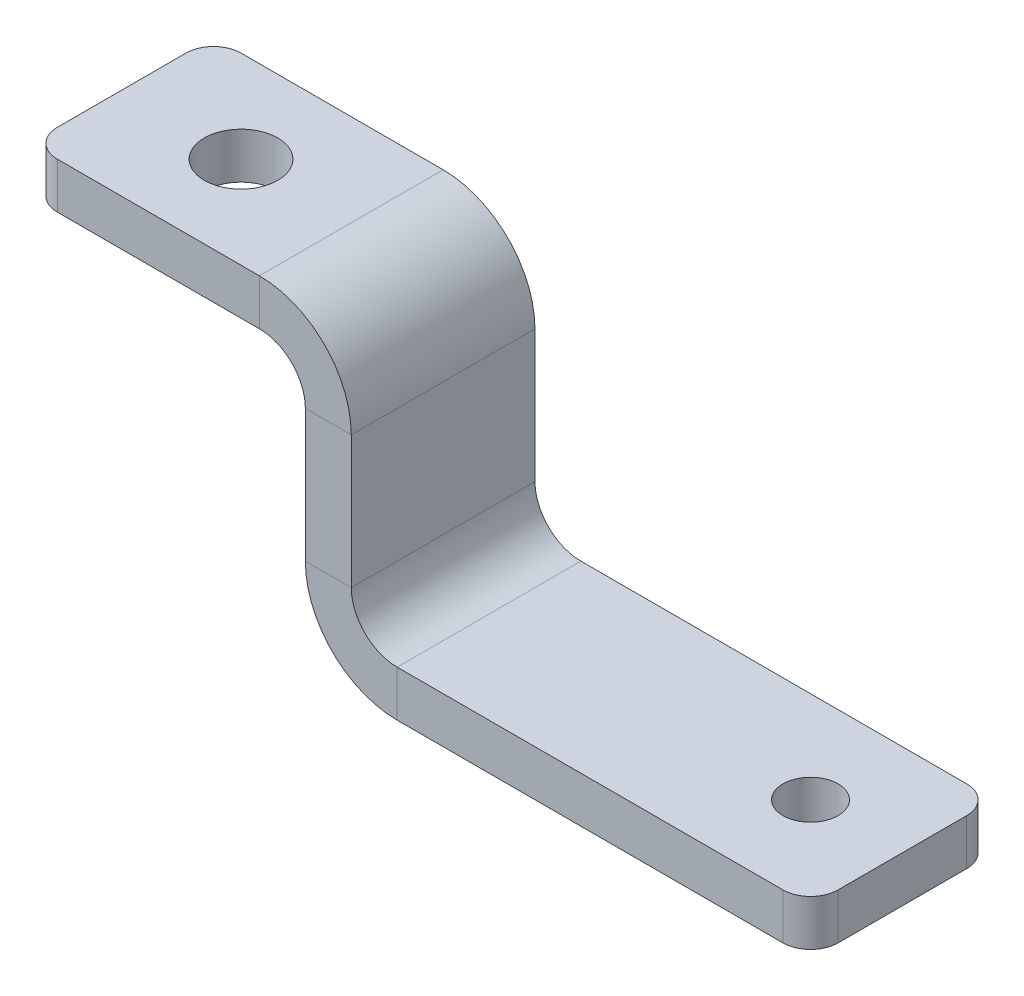
ISO-10303-21;
HEADER;
FILE_DESCRIPTION(('STEP AP214'),'2;1');
FILE_NAME('part.step','',(''),(''),'','','');
FILE_SCHEMA(('AUTOMOTIVE_DESIGN { 1 0 10303 214 1 1 1 1 }'));
ENDSEC;
DATA;
#1=APPLICATION_CONTEXT('core data for automotive mechanical design processes');
#2=APPLICATION_PROTOCOL_DEFINITION('international standard','automotive_design',2000,#1);
#3=PRODUCT_CONTEXT('',#1,'mechanical');
#4=PRODUCT('Part','Part','',(#3));
#5=PRODUCT_RELATED_PRODUCT_CATEGORY('part','',(#4));
#6=PRODUCT_DEFINITION_FORMATION('','',#4);
#7=PRODUCT_DEFINITION_CONTEXT('part definition',#1,'design');
#8=PRODUCT_DEFINITION('design','',#6,#7);
#9=PRODUCT_DEFINITION_SHAPE('','',#8);
#10=(LENGTH_UNIT() NAMED_UNIT(*) SI_UNIT(.MILLI.,.METRE.));
#11=(NAMED_UNIT(*) PLANE_ANGLE_UNIT() SI_UNIT($,.RADIAN.));
#12=(NAMED_UNIT(*) SI_UNIT($,.STERADIAN.) SOLID_ANGLE_UNIT());
#13=UNCERTAINTY_MEASURE_WITH_UNIT(LENGTH_MEASURE(1.E-05),#10,'distance_accuracy_value','');
#14=(GEOMETRIC_REPRESENTATION_CONTEXT(3) GLOBAL_UNCERTAINTY_ASSIGNED_CONTEXT((#13)) GLOBAL_UNIT_ASSIGNED_CONTEXT((#10,
#11,#12)) REPRESENTATION_CONTEXT('',''));
#15=CARTESIAN_POINT('',(0.,0.,0.));
#16=DIRECTION('',(0.,0.,1.));
#17=DIRECTION('',(1.,0.,0.));
#18=AXIS2_PLACEMENT_3D('',#15,#16,#17);
#19=CARTESIAN_POINT('',(0.,29.4,0.));
#20=DIRECTION('',(0.,-1.,0.));
#21=DIRECTION('',(1.,0.,0.));
#22=AXIS2_PLACEMENT_3D('',#19,#20,#21);
#23=PLANE('',#22);
#24=CARTESIAN_POINT('',(-62.,29.4,0.));
#25=DIRECTION('',(0.,1.,0.));
#26=DIRECTION('',(-1.,0.,0.));
#27=AXIS2_PLACEMENT_3D('',#24,#25,#26);
#28=CIRCLE('',#27,4.00000000000001);
#29=CARTESIAN_POINT('',(-66.,29.4,0.));
#30=VERTEX_POINT('',#29);
#31=EDGE_CURVE('E384',#30,#30,#28,.T.);
#32=ORIENTED_EDGE('',*,*,#31,.F.);
#33=EDGE_LOOP('',(#32));
#34=FACE_BOUND('',#33,.T.);
#35=CARTESIAN_POINT('',(-72.0000000000001,29.4,-6.99999999999999));
#36=DIRECTION('',(0.,-1.,0.));
#37=DIRECTION('',(-1.,0.,0.));
#38=AXIS2_PLACEMENT_3D('',#35,#36,#37);
#39=CIRCLE('',#38,3.00000000000001);
#40=CARTESIAN_POINT('',(-75.0000000000001,29.4,-6.99999999999999));
#41=VERTEX_POINT('',#40);
#42=CARTESIAN_POINT('',(-72.0000000000001,29.4,-9.99999999999999));
#43=VERTEX_POINT('',#42);
#44=EDGE_CURVE('E95',#41,#43,#39,.T.);
#45=ORIENTED_EDGE('',*,*,#44,.F.);
#46=DIRECTION('',(0.,0.,1.));
#47=VECTOR('',#46,1.);
#48=CARTESIAN_POINT('',(-75.0000000000001,29.4,0.));
#49=LINE('',#48,#47);
#50=CARTESIAN_POINT('',(-75.0000000000001,29.4,7.));
#51=VERTEX_POINT('',#50);
#52=EDGE_CURVE('E102',#41,#51,#49,.T.);
#53=ORIENTED_EDGE('',*,*,#52,.T.);
#54=CARTESIAN_POINT('',(-72.0000000000001,29.4,7.));
#55=DIRECTION('',(0.,-1.,0.));
#56=DIRECTION('',(-1.,0.,0.));
#57=AXIS2_PLACEMENT_3D('',#54,#55,#56);
#58=CIRCLE('',#57,3.);
#59=CARTESIAN_POINT('',(-72.0000000000001,29.4,10.));
#60=VERTEX_POINT('',#59);
#61=EDGE_CURVE('E206',#60,#51,#58,.T.);
#62=ORIENTED_EDGE('',*,*,#61,.F.);
#63=DIRECTION('',(1.,0.,0.));
#64=VECTOR('',#63,1.);
#65=CARTESIAN_POINT('',(0.,29.4,10.));
#66=LINE('',#65,#64);
#67=CARTESIAN_POINT('',(-50.0000000000001,29.4,10.));
#68=VERTEX_POINT('',#67);
#69=EDGE_CURVE('E245',#60,#68,#66,.T.);
#70=ORIENTED_EDGE('',*,*,#69,.T.);
#71=DIRECTION('',(0.,0.,-1.));
#72=VECTOR('',#71,1.);
#73=CARTESIAN_POINT('',(-50.0000000000001,29.4,10.));
#74=LINE('',#73,#72);
#75=CARTESIAN_POINT('',(-50.0000000000001,29.4,-9.99999999999999));
#76=VERTEX_POINT('',#75);
#77=EDGE_CURVE('E217',#76,#68,#74,.F.);
#78=ORIENTED_EDGE('',*,*,#77,.F.);
#79=DIRECTION('',(-1.,0.,0.));
#80=VECTOR('',#79,1.);
#81=CARTESIAN_POINT('',(0.,29.4,-10.));
#82=LINE('',#81,#80);
#83=EDGE_CURVE('E215',#76,#43,#82,.T.);
#84=ORIENTED_EDGE('',*,*,#83,.T.);
#85=EDGE_LOOP('',(#45,#53,#62,#70,#78,#84));
#86=FACE_BOUND('',#85,.T.);
#87=ADVANCED_FACE('F78',(#34,#86),#23,.F.);
#88=CARTESIAN_POINT('',(0.,24.4,0.));
#89=DIRECTION('',(0.,-1.,0.));
#90=DIRECTION('',(1.,0.,0.));
#91=AXIS2_PLACEMENT_3D('',#88,#89,#90);
#92=PLANE('',#91);
#93=CARTESIAN_POINT('',(-62.,24.4,0.));
#94=DIRECTION('',(0.,1.,0.));
#95=DIRECTION('',(-1.,0.,0.));
#96=AXIS2_PLACEMENT_3D('',#93,#94,#95);
#97=CIRCLE('',#96,4.00000000000001);
#98=CARTESIAN_POINT('',(-66.,24.4,0.));
#99=VERTEX_POINT('',#98);
#100=EDGE_CURVE('E231',#99,#99,#97,.T.);
#101=ORIENTED_EDGE('',*,*,#100,.T.);
#102=EDGE_LOOP('',(#101));
#103=FACE_BOUND('',#102,.T.);
#104=DIRECTION('',(0.,0.,-1.));
#105=VECTOR('',#104,1.);
#106=CARTESIAN_POINT('',(-75.0000000000001,24.4,10.));
#107=LINE('',#106,#105);
#108=CARTESIAN_POINT('',(-75.0000000000001,24.4,-6.99999999999999));
#109=VERTEX_POINT('',#108);
#110=CARTESIAN_POINT('',(-75.0000000000001,24.4,7.));
#111=VERTEX_POINT('',#110);
#112=EDGE_CURVE('E204',#109,#111,#107,.F.);
#113=ORIENTED_EDGE('',*,*,#112,.F.);
#114=CARTESIAN_POINT('',(-72.0000000000001,24.4,-6.99999999999999));
#115=DIRECTION('',(0.,-1.,0.));
#116=DIRECTION('',(1.,0.,0.));
#117=AXIS2_PLACEMENT_3D('',#114,#115,#116);
#118=CIRCLE('',#117,3.00000000000001);
#119=CARTESIAN_POINT('',(-72.0000000000001,24.4,-9.99999999999999));
#120=VERTEX_POINT('',#119);
#121=EDGE_CURVE('E191',#109,#120,#118,.T.);
#122=ORIENTED_EDGE('',*,*,#121,.T.);
#123=DIRECTION('',(1.,0.,0.));
#124=VECTOR('',#123,1.);
#125=CARTESIAN_POINT('',(-75.0000000000001,24.4,-9.99999999999999));
#126=LINE('',#125,#124);
#127=CARTESIAN_POINT('',(-50.0000000000001,24.4,-9.99999999999999));
#128=VERTEX_POINT('',#127);
#129=EDGE_CURVE('E213',#128,#120,#126,.F.);
#130=ORIENTED_EDGE('',*,*,#129,.F.);
#131=DIRECTION('',(0.,0.,-1.));
#132=VECTOR('',#131,1.);
#133=CARTESIAN_POINT('',(-50.0000000000001,24.4,10.));
#134=LINE('',#133,#132);
#135=CARTESIAN_POINT('',(-50.0000000000001,24.4,10.));
#136=VERTEX_POINT('',#135);
#137=EDGE_CURVE('E226',#136,#128,#134,.T.);
#138=ORIENTED_EDGE('',*,*,#137,.F.);
#139=DIRECTION('',(-1.,0.,0.));
#140=VECTOR('',#139,1.);
#141=CARTESIAN_POINT('',(-45.0000000000001,24.4,10.));
#142=LINE('',#141,#140);
#143=CARTESIAN_POINT('',(-72.0000000000001,24.4,10.));
#144=VERTEX_POINT('',#143);
#145=EDGE_CURVE('E212',#144,#136,#142,.F.);
#146=ORIENTED_EDGE('',*,*,#145,.F.);
#147=CARTESIAN_POINT('',(-72.0000000000001,24.4,7.));
#148=DIRECTION('',(0.,-1.,0.));
#149=DIRECTION('',(1.,0.,0.));
#150=AXIS2_PLACEMENT_3D('',#147,#148,#149);
#151=CIRCLE('',#150,3.);
#152=EDGE_CURVE('E211',#144,#111,#151,.T.);
#153=ORIENTED_EDGE('',*,*,#152,.T.);
#154=EDGE_LOOP('',(#113,#122,#130,#138,#146,#153));
#155=FACE_BOUND('',#154,.T.);
#156=ADVANCED_FACE('F209',(#103,#155),#92,.T.);
#157=CARTESIAN_POINT('',(-75.0000000000001,29.4,-9.99999999999999));
#158=DIRECTION('',(0.,0.,1.));
#159=DIRECTION('',(1.,0.,0.));
#160=AXIS2_PLACEMENT_3D('',#157,#158,#159);
#161=PLANE('',#160);
#162=DIRECTION('',(0.,1.,0.));
#163=VECTOR('',#162,1.);
#164=CARTESIAN_POINT('',(-72.0000000000001,29.4,-9.99999999999999));
#165=LINE('',#164,#163);
#166=EDGE_CURVE('E195',#43,#120,#165,.F.);
#167=ORIENTED_EDGE('',*,*,#166,.F.);
#168=ORIENTED_EDGE('',*,*,#83,.F.);
#169=DIRECTION('',(0.,-1.,0.));
#170=VECTOR('',#169,1.);
#171=CARTESIAN_POINT('',(-50.0000000000001,24.4,-9.99999999999999));
#172=LINE('',#171,#170);
#173=EDGE_CURVE('E223',#128,#76,#172,.F.);
#174=ORIENTED_EDGE('',*,*,#173,.F.);
#175=ORIENTED_EDGE('',*,*,#129,.T.);
#176=EDGE_LOOP('',(#167,#168,#174,#175));
#177=FACE_BOUND('',#176,.T.);
#178=ADVANCED_FACE('F368',(#177),#161,.F.);
#179=CARTESIAN_POINT('',(-75.0000000000001,29.4,10.));
#180=DIRECTION('',(1.,0.,0.));
#181=DIRECTION('',(0.,1.,0.));
#182=AXIS2_PLACEMENT_3D('',#179,#180,#181);
#183=PLANE('',#182);
#184=ORIENTED_EDGE('',*,*,#52,.F.);
#185=DIRECTION('',(0.,1.,0.));
#186=VECTOR('',#185,1.);
#187=CARTESIAN_POINT('',(-75.0000000000001,29.4,-6.99999999999999));
#188=LINE('',#187,#186);
#189=EDGE_CURVE('E194',#41,#109,#188,.F.);
#190=ORIENTED_EDGE('',*,*,#189,.T.);
#191=ORIENTED_EDGE('',*,*,#112,.T.);
#192=DIRECTION('',(0.,1.,0.));
#193=VECTOR('',#192,1.);
#194=CARTESIAN_POINT('',(-75.0000000000001,29.4,7.));
#195=LINE('',#194,#193);
#196=EDGE_CURVE('E385',#51,#111,#195,.F.);
#197=ORIENTED_EDGE('',*,*,#196,.F.);
#198=EDGE_LOOP('',(#184,#190,#191,#197));
#199=FACE_BOUND('',#198,.T.);
#200=ADVANCED_FACE('F202',(#199),#183,.F.);
#201=CARTESIAN_POINT('',(-35.,-5.,-10.));
#202=DIRECTION('',(0.,0.,-1.));
#203=DIRECTION('',(-1.,0.,0.));
#204=AXIS2_PLACEMENT_3D('',#201,#202,#203);
#205=PLANE('',#204);
#206=DIRECTION('',(-1.,0.,0.));
#207=VECTOR('',#206,1.);
#208=CARTESIAN_POINT('',(-35.,0.,-10.));
#209=LINE('',#208,#207);
#210=CARTESIAN_POINT('',(7.,0.,-10.));
#211=VERTEX_POINT('',#210);
#212=CARTESIAN_POINT('',(-35.,0.,-10.));
#213=VERTEX_POINT('',#212);
#214=EDGE_CURVE('E302',#211,#213,#209,.T.);
#215=ORIENTED_EDGE('',*,*,#214,.F.);
#216=DIRECTION('',(0.,1.,0.));
#217=VECTOR('',#216,1.);
#218=CARTESIAN_POINT('',(7.,-5.,-10.));
#219=LINE('',#218,#217);
#220=CARTESIAN_POINT('',(7.,-5.,-10.));
#221=VERTEX_POINT('',#220);
#222=EDGE_CURVE('E87',#221,#211,#219,.T.);
#223=ORIENTED_EDGE('',*,*,#222,.F.);
#224=DIRECTION('',(-1.,0.,0.));
#225=VECTOR('',#224,1.);
#226=CARTESIAN_POINT('',(-35.,-5.,-10.));
#227=LINE('',#226,#225);
#228=CARTESIAN_POINT('',(-35.,-5.,-10.));
#229=VERTEX_POINT('',#228);
#230=EDGE_CURVE('E314',#221,#229,#227,.T.);
#231=ORIENTED_EDGE('',*,*,#230,.T.);
#232=DIRECTION('',(0.,1.,0.));
#233=VECTOR('',#232,1.);
#234=CARTESIAN_POINT('',(-35.,-5.,-10.));
#235=LINE('',#234,#233);
#236=EDGE_CURVE('E13',#229,#213,#235,.T.);
#237=ORIENTED_EDGE('',*,*,#236,.T.);
#238=EDGE_LOOP('',(#215,#223,#231,#237));
#239=FACE_BOUND('',#238,.T.);
#240=ADVANCED_FACE('F418',(#239),#205,.T.);
#241=CARTESIAN_POINT('',(7.,-5.,-7.));
#242=DIRECTION('',(0.,1.,0.));
#243=DIRECTION('',(0.,0.,1.));
#244=AXIS2_PLACEMENT_3D('',#241,#242,#243);
#245=CYLINDRICAL_SURFACE('',#244,3.);
#246=CARTESIAN_POINT('',(7.,0.,-7.));
#247=DIRECTION('',(0.,1.,0.));
#248=DIRECTION('',(0.,0.,-1.));
#249=AXIS2_PLACEMENT_3D('',#246,#247,#248);
#250=CIRCLE('',#249,3.);
#251=CARTESIAN_POINT('',(10.,0.,-7.));
#252=VERTEX_POINT('',#251);
#253=EDGE_CURVE('E328',#252,#211,#250,.T.);
#254=ORIENTED_EDGE('',*,*,#253,.F.);
#255=DIRECTION('',(0.,1.,0.));
#256=VECTOR('',#255,1.);
#257=CARTESIAN_POINT('',(10.,-5.,-7.));
#258=LINE('',#257,#256);
#259=CARTESIAN_POINT('',(10.,-5.,-7.));
#260=VERTEX_POINT('',#259);
#261=EDGE_CURVE('E334',#260,#252,#258,.T.);
#262=ORIENTED_EDGE('',*,*,#261,.F.);
#263=CARTESIAN_POINT('',(7.,-5.,-7.));
#264=DIRECTION('',(0.,1.,0.));
#265=DIRECTION('',(0.,0.,-1.));
#266=AXIS2_PLACEMENT_3D('',#263,#264,#265);
#267=CIRCLE('',#266,3.);
#268=EDGE_CURVE('E311',#260,#221,#267,.T.);
#269=ORIENTED_EDGE('',*,*,#268,.T.);
#270=ORIENTED_EDGE('',*,*,#222,.T.);
#271=EDGE_LOOP('',(#254,#262,#269,#270));
#272=FACE_BOUND('',#271,.T.);
#273=ADVANCED_FACE('F467',(#272),#245,.T.);
#274=CARTESIAN_POINT('',(10.,-5.,-7.));
#275=DIRECTION('',(1.,0.,0.));
#276=DIRECTION('',(0.,0.,-1.));
#277=AXIS2_PLACEMENT_3D('',#274,#275,#276);
#278=PLANE('',#277);
#279=DIRECTION('',(0.,0.,-1.));
#280=VECTOR('',#279,1.);
#281=CARTESIAN_POINT('',(10.,0.,-7.));
#282=LINE('',#281,#280);
#283=CARTESIAN_POINT('',(10.,0.,7.));
#284=VERTEX_POINT('',#283);
#285=EDGE_CURVE('E325',#284,#252,#282,.T.);
#286=ORIENTED_EDGE('',*,*,#285,.F.);
#287=DIRECTION('',(0.,1.,0.));
#288=VECTOR('',#287,1.);
#289=CARTESIAN_POINT('',(10.,-5.,7.));
#290=LINE('',#289,#288);
#291=CARTESIAN_POINT('',(10.,-5.,7.));
#292=VERTEX_POINT('',#291);
#293=EDGE_CURVE('E336',#292,#284,#290,.T.);
#294=ORIENTED_EDGE('',*,*,#293,.F.);
#295=DIRECTION('',(0.,0.,-1.));
#296=VECTOR('',#295,1.);
#297=CARTESIAN_POINT('',(10.,-5.,-7.));
#298=LINE('',#297,#296);
#299=EDGE_CURVE('E308',#292,#260,#298,.T.);
#300=ORIENTED_EDGE('',*,*,#299,.T.);
#301=ORIENTED_EDGE('',*,*,#261,.T.);
#302=EDGE_LOOP('',(#286,#294,#300,#301));
#303=FACE_BOUND('',#302,.T.);
#304=ADVANCED_FACE('F471',(#303),#278,.T.);
#305=CARTESIAN_POINT('',(7.,-5.,7.));
#306=DIRECTION('',(0.,1.,0.));
#307=DIRECTION('',(0.,0.,1.));
#308=AXIS2_PLACEMENT_3D('',#305,#306,#307);
#309=CYLINDRICAL_SURFACE('',#308,3.);
#310=CARTESIAN_POINT('',(7.,0.,7.));
#311=DIRECTION('',(0.,1.,0.));
#312=DIRECTION('',(0.,0.,1.));
#313=AXIS2_PLACEMENT_3D('',#310,#311,#312);
#314=CIRCLE('',#313,3.);
#315=CARTESIAN_POINT('',(7.,0.,10.));
#316=VERTEX_POINT('',#315);
#317=EDGE_CURVE('E322',#316,#284,#314,.T.);
#318=ORIENTED_EDGE('',*,*,#317,.F.);
#319=DIRECTION('',(0.,1.,0.));
#320=VECTOR('',#319,1.);
#321=CARTESIAN_POINT('',(7.,-5.,10.));
#322=LINE('',#321,#320);
#323=CARTESIAN_POINT('',(7.,-5.,10.));
#324=VERTEX_POINT('',#323);
#325=EDGE_CURVE('E337',#324,#316,#322,.T.);
#326=ORIENTED_EDGE('',*,*,#325,.F.);
#327=CARTESIAN_POINT('',(7.,-5.,7.));
#328=DIRECTION('',(0.,1.,0.));
#329=DIRECTION('',(0.,0.,1.));
#330=AXIS2_PLACEMENT_3D('',#327,#328,#329);
#331=CIRCLE('',#330,3.);
#332=EDGE_CURVE('E305',#324,#292,#331,.T.);
#333=ORIENTED_EDGE('',*,*,#332,.T.);
#334=ORIENTED_EDGE('',*,*,#293,.T.);
#335=EDGE_LOOP('',(#318,#326,#333,#334));
#336=FACE_BOUND('',#335,.T.);
#337=ADVANCED_FACE('F474',(#336),#309,.T.);
#338=CARTESIAN_POINT('',(-35.,-5.,10.));
#339=DIRECTION('',(0.,0.,1.));
#340=DIRECTION('',(1.,0.,0.));
#341=AXIS2_PLACEMENT_3D('',#338,#339,#340);
#342=PLANE('',#341);
#343=DIRECTION('',(1.,0.,0.));
#344=VECTOR('',#343,1.);
#345=CARTESIAN_POINT('',(-35.,0.,10.));
#346=LINE('',#345,#344);
#347=CARTESIAN_POINT('',(-35.,0.,10.));
#348=VERTEX_POINT('',#347);
#349=EDGE_CURVE('E319',#348,#316,#346,.T.);
#350=ORIENTED_EDGE('',*,*,#349,.F.);
#351=DIRECTION('',(0.,1.,0.));
#352=VECTOR('',#351,1.);
#353=CARTESIAN_POINT('',(-35.,-5.,10.));
#354=LINE('',#353,#352);
#355=CARTESIAN_POINT('',(-35.,-5.,10.));
#356=VERTEX_POINT('',#355);
#357=EDGE_CURVE('E82',#356,#348,#354,.T.);
#358=ORIENTED_EDGE('',*,*,#357,.F.);
#359=DIRECTION('',(1.,0.,0.));
#360=VECTOR('',#359,1.);
#361=CARTESIAN_POINT('',(-35.,-5.,10.));
#362=LINE('',#361,#360);
#363=EDGE_CURVE('E301',#356,#324,#362,.T.);
#364=ORIENTED_EDGE('',*,*,#363,.T.);
#365=ORIENTED_EDGE('',*,*,#325,.T.);
#366=EDGE_LOOP('',(#350,#358,#364,#365));
#367=FACE_BOUND('',#366,.T.);
#368=ADVANCED_FACE('F80',(#367),#342,.T.);
#369=CARTESIAN_POINT('',(7.,-5.,7.));
#370=DIRECTION('',(0.,1.,0.));
#371=DIRECTION('',(0.,0.,1.));
#372=AXIS2_PLACEMENT_3D('',#369,#370,#371);
#373=PLANE('',#372);
#374=CARTESIAN_POINT('',(0.,-5.,0.));
#375=DIRECTION('',(0.,1.,0.));
#376=DIRECTION('',(0.,0.,1.));
#377=AXIS2_PLACEMENT_3D('',#374,#375,#376);
#378=CIRCLE('',#377,3.);
#379=CARTESIAN_POINT('',(0.,-5.,3.));
#380=VERTEX_POINT('',#379);
#381=EDGE_CURVE('E292',#380,#380,#378,.T.);
#382=ORIENTED_EDGE('',*,*,#381,.T.);
#383=EDGE_LOOP('',(#382));
#384=FACE_BOUND('',#383,.T.);
#385=DIRECTION('',(0.,0.,1.));
#386=VECTOR('',#385,1.);
#387=CARTESIAN_POINT('',(-35.,-5.,-10.));
#388=LINE('',#387,#386);
#389=EDGE_CURVE('E298',#229,#356,#388,.T.);
#390=ORIENTED_EDGE('',*,*,#389,.F.);
#391=ORIENTED_EDGE('',*,*,#230,.F.);
#392=ORIENTED_EDGE('',*,*,#268,.F.);
#393=ORIENTED_EDGE('',*,*,#299,.F.);
#394=ORIENTED_EDGE('',*,*,#332,.F.);
#395=ORIENTED_EDGE('',*,*,#363,.F.);
#396=EDGE_LOOP('',(#390,#391,#392,#393,#394,#395));
#397=FACE_BOUND('',#396,.T.);
#398=ADVANCED_FACE('F458',(#384,#397),#373,.F.);
#399=CARTESIAN_POINT('',(7.,0.,7.));
#400=DIRECTION('',(0.,1.,0.));
#401=DIRECTION('',(0.,0.,1.));
#402=AXIS2_PLACEMENT_3D('',#399,#400,#401);
#403=PLANE('',#402);
#404=CARTESIAN_POINT('',(0.,0.,0.));
#405=DIRECTION('',(0.,1.,0.));
#406=DIRECTION('',(0.,0.,1.));
#407=AXIS2_PLACEMENT_3D('',#404,#405,#406);
#408=CIRCLE('',#407,3.);
#409=CARTESIAN_POINT('',(0.,0.,3.));
#410=VERTEX_POINT('',#409);
#411=EDGE_CURVE('E283',#410,#410,#408,.T.);
#412=ORIENTED_EDGE('',*,*,#411,.F.);
#413=EDGE_LOOP('',(#412));
#414=FACE_BOUND('',#413,.T.);
#415=DIRECTION('',(0.,0.,1.));
#416=VECTOR('',#415,1.);
#417=CARTESIAN_POINT('',(-35.,0.,-10.));
#418=LINE('',#417,#416);
#419=EDGE_CURVE('E295',#213,#348,#418,.T.);
#420=ORIENTED_EDGE('',*,*,#419,.T.);
#421=ORIENTED_EDGE('',*,*,#349,.T.);
#422=ORIENTED_EDGE('',*,*,#317,.T.);
#423=ORIENTED_EDGE('',*,*,#285,.T.);
#424=ORIENTED_EDGE('',*,*,#253,.T.);
#425=ORIENTED_EDGE('',*,*,#214,.T.);
#426=EDGE_LOOP('',(#420,#421,#422,#423,#424,#425));
#427=FACE_BOUND('',#426,.T.);
#428=ADVANCED_FACE('F456',(#414,#427),#403,.T.);
#429=CARTESIAN_POINT('',(0.,-5.,0.));
#430=DIRECTION('',(0.,1.,0.));
#431=DIRECTION('',(0.,0.,1.));
#432=AXIS2_PLACEMENT_3D('',#429,#430,#431);
#433=CYLINDRICAL_SURFACE('',#432,3.);
#434=ORIENTED_EDGE('',*,*,#381,.F.);
#435=EDGE_LOOP('',(#434));
#436=FACE_BOUND('',#435,.T.);
#437=ORIENTED_EDGE('',*,*,#411,.T.);
#438=EDGE_LOOP('',(#437));
#439=FACE_BOUND('',#438,.T.);
#440=ADVANCED_FACE('F450',(#436,#439),#433,.F.);
#441=CARTESIAN_POINT('',(-35.,5.,-10.));
#442=DIRECTION('',(0.,0.,-1.));
#443=DIRECTION('',(-1.,0.,0.));
#444=AXIS2_PLACEMENT_3D('',#441,#442,#443);
#445=PLANE('',#444);
#446=DIRECTION('',(-1.,0.,0.));
#447=VECTOR('',#446,1.);
#448=CARTESIAN_POINT('',(-45.,4.99999999999997,-10.));
#449=LINE('',#448,#447);
#450=CARTESIAN_POINT('',(-40.,4.99999999999998,-10.));
#451=VERTEX_POINT('',#450);
#452=CARTESIAN_POINT('',(-45.,4.99999999999997,-10.));
#453=VERTEX_POINT('',#452);
#454=EDGE_CURVE('E235',#451,#453,#449,.T.);
#455=ORIENTED_EDGE('',*,*,#454,.F.);
#456=CARTESIAN_POINT('',(-35.,5.,-10.));
#457=DIRECTION('',(0.,0.,1.));
#458=DIRECTION('',(1.,0.,0.));
#459=AXIS2_PLACEMENT_3D('',#456,#457,#458);
#460=CIRCLE('',#459,5.);
#461=EDGE_CURVE('E287',#213,#451,#460,.F.);
#462=ORIENTED_EDGE('',*,*,#461,.F.);
#463=ORIENTED_EDGE('',*,*,#236,.F.);
#464=CARTESIAN_POINT('',(-35.,5.,-10.));
#465=DIRECTION('',(0.,0.,1.));
#466=DIRECTION('',(1.,0.,0.));
#467=AXIS2_PLACEMENT_3D('',#464,#465,#466);
#468=CIRCLE('',#467,10.);
#469=EDGE_CURVE('E280',#229,#453,#468,.F.);
#470=ORIENTED_EDGE('',*,*,#469,.T.);
#471=EDGE_LOOP('',(#455,#462,#463,#470));
#472=FACE_BOUND('',#471,.T.);
#473=ADVANCED_FACE('F447',(#472),#445,.T.);
#474=CARTESIAN_POINT('',(-35.,5.,10.));
#475=DIRECTION('',(0.,0.,-1.));
#476=DIRECTION('',(-1.,0.,0.));
#477=AXIS2_PLACEMENT_3D('',#474,#475,#476);
#478=PLANE('',#477);
#479=CARTESIAN_POINT('',(-35.,5.,10.));
#480=DIRECTION('',(0.,0.,1.));
#481=DIRECTION('',(1.,0.,0.));
#482=AXIS2_PLACEMENT_3D('',#479,#480,#481);
#483=CIRCLE('',#482,5.);
#484=CARTESIAN_POINT('',(-40.,4.99999999999998,10.));
#485=VERTEX_POINT('',#484);
#486=EDGE_CURVE('E249',#485,#348,#483,.T.);
#487=ORIENTED_EDGE('',*,*,#486,.F.);
#488=DIRECTION('',(-1.,0.,0.));
#489=VECTOR('',#488,1.);
#490=CARTESIAN_POINT('',(-40.,4.99999999999998,10.));
#491=LINE('',#490,#489);
#492=CARTESIAN_POINT('',(-45.,4.99999999999997,10.));
#493=VERTEX_POINT('',#492);
#494=EDGE_CURVE('E273',#485,#493,#491,.T.);
#495=ORIENTED_EDGE('',*,*,#494,.T.);
#496=CARTESIAN_POINT('',(-35.,5.,10.));
#497=DIRECTION('',(0.,0.,1.));
#498=DIRECTION('',(1.,0.,0.));
#499=AXIS2_PLACEMENT_3D('',#496,#497,#498);
#500=CIRCLE('',#499,10.);
#501=EDGE_CURVE('E284',#493,#356,#500,.T.);
#502=ORIENTED_EDGE('',*,*,#501,.T.);
#503=ORIENTED_EDGE('',*,*,#357,.T.);
#504=EDGE_LOOP('',(#487,#495,#502,#503));
#505=FACE_BOUND('',#504,.T.);
#506=ADVANCED_FACE('F344',(#505),#478,.F.);
#507=CARTESIAN_POINT('',(-35.,5.,10.));
#508=DIRECTION('',(0.,0.,1.));
#509=DIRECTION('',(-1.,0.,0.));
#510=AXIS2_PLACEMENT_3D('',#507,#508,#509);
#511=CYLINDRICAL_SURFACE('',#510,10.);
#512=ORIENTED_EDGE('',*,*,#389,.T.);
#513=ORIENTED_EDGE('',*,*,#501,.F.);
#514=DIRECTION('',(0.,0.,1.));
#515=VECTOR('',#514,1.);
#516=CARTESIAN_POINT('',(-45.,4.99999999999997,0.));
#517=LINE('',#516,#515);
#518=EDGE_CURVE('E270',#453,#493,#517,.T.);
#519=ORIENTED_EDGE('',*,*,#518,.F.);
#520=ORIENTED_EDGE('',*,*,#469,.F.);
#521=EDGE_LOOP('',(#512,#513,#519,#520));
#522=FACE_BOUND('',#521,.T.);
#523=ADVANCED_FACE('F441',(#522),#511,.T.);
#524=CARTESIAN_POINT('',(-35.,5.,10.));
#525=DIRECTION('',(0.,0.,1.));
#526=DIRECTION('',(-1.,0.,0.));
#527=AXIS2_PLACEMENT_3D('',#524,#525,#526);
#528=CYLINDRICAL_SURFACE('',#527,5.);
#529=ORIENTED_EDGE('',*,*,#419,.F.);
#530=ORIENTED_EDGE('',*,*,#461,.T.);
#531=DIRECTION('',(0.,0.,-1.));
#532=VECTOR('',#531,1.);
#533=CARTESIAN_POINT('',(-40.,4.99999999999998,-10.));
#534=LINE('',#533,#532);
#535=EDGE_CURVE('E276',#451,#485,#534,.F.);
#536=ORIENTED_EDGE('',*,*,#535,.T.);
#537=ORIENTED_EDGE('',*,*,#486,.T.);
#538=EDGE_LOOP('',(#529,#530,#536,#537));
#539=FACE_BOUND('',#538,.T.);
#540=ADVANCED_FACE('F347',(#539),#528,.F.);
#541=CARTESIAN_POINT('',(-45.,0.,10.));
#542=DIRECTION('',(0.,0.,1.));
#543=DIRECTION('',(1.,0.,0.));
#544=AXIS2_PLACEMENT_3D('',#541,#542,#543);
#545=PLANE('',#544);
#546=DIRECTION('',(0.,-1.,0.));
#547=VECTOR('',#546,1.);
#548=CARTESIAN_POINT('',(-45.,0.,10.));
#549=LINE('',#548,#547);
#550=CARTESIAN_POINT('',(-45.0000000000001,19.4,10.));
#551=VERTEX_POINT('',#550);
#552=EDGE_CURVE('E253',#551,#493,#549,.T.);
#553=ORIENTED_EDGE('',*,*,#552,.T.);
#554=ORIENTED_EDGE('',*,*,#494,.F.);
#555=DIRECTION('',(0.,1.,0.));
#556=VECTOR('',#555,1.);
#557=CARTESIAN_POINT('',(-40.,-1.2518623022513E-13,10.));
#558=LINE('',#557,#556);
#559=CARTESIAN_POINT('',(-40.,19.4,10.));
#560=VERTEX_POINT('',#559);
#561=EDGE_CURVE('E261',#560,#485,#558,.F.);
#562=ORIENTED_EDGE('',*,*,#561,.F.);
#563=DIRECTION('',(1.,0.,0.));
#564=VECTOR('',#563,1.);
#565=CARTESIAN_POINT('',(-45.,19.4,10.));
#566=LINE('',#565,#564);
#567=EDGE_CURVE('E246',#551,#560,#566,.T.);
#568=ORIENTED_EDGE('',*,*,#567,.F.);
#569=EDGE_LOOP('',(#553,#554,#562,#568));
#570=FACE_BOUND('',#569,.T.);
#571=ADVANCED_FACE('F435',(#570),#545,.T.);
#572=CARTESIAN_POINT('',(-45.,19.4,-10.));
#573=DIRECTION('',(0.,0.,-1.));
#574=DIRECTION('',(0.,1.,0.));
#575=AXIS2_PLACEMENT_3D('',#572,#573,#574);
#576=PLANE('',#575);
#577=DIRECTION('',(0.,-1.,0.));
#578=VECTOR('',#577,1.);
#579=CARTESIAN_POINT('',(-40.,-1.24292042866379E-13,-10.));
#580=LINE('',#579,#578);
#581=CARTESIAN_POINT('',(-40.,19.4,-9.99999999999999));
#582=VERTEX_POINT('',#581);
#583=EDGE_CURVE('E267',#451,#582,#580,.F.);
#584=ORIENTED_EDGE('',*,*,#583,.F.);
#585=ORIENTED_EDGE('',*,*,#454,.T.);
#586=DIRECTION('',(0.,1.,0.));
#587=VECTOR('',#586,1.);
#588=CARTESIAN_POINT('',(-45.,19.4,-10.));
#589=LINE('',#588,#587);
#590=CARTESIAN_POINT('',(-45.0000000000001,19.4,-9.99999999999999));
#591=VERTEX_POINT('',#590);
#592=EDGE_CURVE('E258',#453,#591,#589,.T.);
#593=ORIENTED_EDGE('',*,*,#592,.T.);
#594=DIRECTION('',(1.,0.,0.));
#595=VECTOR('',#594,1.);
#596=CARTESIAN_POINT('',(-45.,19.4,-10.));
#597=LINE('',#596,#595);
#598=EDGE_CURVE('E250',#591,#582,#597,.T.);
#599=ORIENTED_EDGE('',*,*,#598,.T.);
#600=EDGE_LOOP('',(#584,#585,#593,#599));
#601=FACE_BOUND('',#600,.T.);
#602=ADVANCED_FACE('F356',(#601),#576,.T.);
#603=CARTESIAN_POINT('',(-45.,-1.42643636919346E-13,0.));
#604=DIRECTION('',(-1.,0.,0.));
#605=DIRECTION('',(0.,-1.,0.));
#606=AXIS2_PLACEMENT_3D('',#603,#604,#605);
#607=PLANE('',#606);
#608=ORIENTED_EDGE('',*,*,#592,.F.);
#609=ORIENTED_EDGE('',*,*,#518,.T.);
#610=ORIENTED_EDGE('',*,*,#552,.F.);
#611=DIRECTION('',(0.,0.,1.));
#612=VECTOR('',#611,1.);
#613=CARTESIAN_POINT('',(-45.,19.4,10.));
#614=LINE('',#613,#612);
#615=EDGE_CURVE('E256',#591,#551,#614,.T.);
#616=ORIENTED_EDGE('',*,*,#615,.F.);
#617=EDGE_LOOP('',(#608,#609,#610,#616));
#618=FACE_BOUND('',#617,.T.);
#619=ADVANCED_FACE('F429',(#618),#607,.T.);
#620=CARTESIAN_POINT('',(-40.,-1.2518623022513E-13,0.));
#621=DIRECTION('',(-1.,0.,0.));
#622=DIRECTION('',(0.,-1.,0.));
#623=AXIS2_PLACEMENT_3D('',#620,#621,#622);
#624=PLANE('',#623);
#625=ORIENTED_EDGE('',*,*,#535,.F.);
#626=ORIENTED_EDGE('',*,*,#583,.T.);
#627=DIRECTION('',(0.,0.,-1.));
#628=VECTOR('',#627,1.);
#629=CARTESIAN_POINT('',(-40.,19.4,0.));
#630=LINE('',#629,#628);
#631=EDGE_CURVE('E264',#582,#560,#630,.F.);
#632=ORIENTED_EDGE('',*,*,#631,.T.);
#633=ORIENTED_EDGE('',*,*,#561,.T.);
#634=EDGE_LOOP('',(#625,#626,#632,#633));
#635=FACE_BOUND('',#634,.T.);
#636=ADVANCED_FACE('F352',(#635),#624,.F.);
#637=CARTESIAN_POINT('',(-50.0000000000001,19.4,10.));
#638=DIRECTION('',(0.,0.,1.));
#639=DIRECTION('',(1.,0.,0.));
#640=AXIS2_PLACEMENT_3D('',#637,#638,#639);
#641=PLANE('',#640);
#642=DIRECTION('',(0.,-1.,0.));
#643=VECTOR('',#642,1.);
#644=CARTESIAN_POINT('',(-50.0000000000001,29.4,10.));
#645=LINE('',#644,#643);
#646=EDGE_CURVE('E228',#136,#68,#645,.F.);
#647=ORIENTED_EDGE('',*,*,#646,.F.);
#648=CARTESIAN_POINT('',(-50.0000000000001,19.4,10.));
#649=DIRECTION('',(0.,0.,-1.));
#650=DIRECTION('',(-1.,0.,0.));
#651=AXIS2_PLACEMENT_3D('',#648,#649,#650);
#652=CIRCLE('',#651,5.);
#653=EDGE_CURVE('E239',#551,#136,#652,.F.);
#654=ORIENTED_EDGE('',*,*,#653,.F.);
#655=ORIENTED_EDGE('',*,*,#567,.T.);
#656=CARTESIAN_POINT('',(-50.0000000000001,19.4,10.));
#657=DIRECTION('',(0.,0.,-1.));
#658=DIRECTION('',(-1.,0.,0.));
#659=AXIS2_PLACEMENT_3D('',#656,#657,#658);
#660=CIRCLE('',#659,10.);
#661=EDGE_CURVE('E232',#560,#68,#660,.F.);
#662=ORIENTED_EDGE('',*,*,#661,.T.);
#663=EDGE_LOOP('',(#647,#654,#655,#662));
#664=FACE_BOUND('',#663,.T.);
#665=ADVANCED_FACE('F377',(#664),#641,.T.);
#666=CARTESIAN_POINT('',(-50.0000000000001,19.4,-9.99999999999999));
#667=DIRECTION('',(0.,0.,1.));
#668=DIRECTION('',(1.,0.,0.));
#669=AXIS2_PLACEMENT_3D('',#666,#667,#668);
#670=PLANE('',#669);
#671=CARTESIAN_POINT('',(-50.0000000000001,19.4,-9.99999999999999));
#672=DIRECTION('',(0.,0.,-1.));
#673=DIRECTION('',(-1.,0.,0.));
#674=AXIS2_PLACEMENT_3D('',#671,#672,#673);
#675=CIRCLE('',#674,5.);
#676=EDGE_CURVE('E242',#128,#591,#675,.T.);
#677=ORIENTED_EDGE('',*,*,#676,.F.);
#678=ORIENTED_EDGE('',*,*,#173,.T.);
#679=CARTESIAN_POINT('',(-50.0000000000001,19.4,-9.99999999999999));
#680=DIRECTION('',(0.,0.,-1.));
#681=DIRECTION('',(-1.,0.,0.));
#682=AXIS2_PLACEMENT_3D('',#679,#680,#681);
#683=CIRCLE('',#682,10.);
#684=EDGE_CURVE('E236',#76,#582,#683,.T.);
#685=ORIENTED_EDGE('',*,*,#684,.T.);
#686=ORIENTED_EDGE('',*,*,#598,.F.);
#687=EDGE_LOOP('',(#677,#678,#685,#686));
#688=FACE_BOUND('',#687,.T.);
#689=ADVANCED_FACE('F361',(#688),#670,.F.);
#690=CARTESIAN_POINT('',(-50.0000000000001,19.4,-9.99999999999999));
#691=DIRECTION('',(0.,0.,-1.));
#692=DIRECTION('',(0.,1.,0.));
#693=AXIS2_PLACEMENT_3D('',#690,#691,#692);
#694=CYLINDRICAL_SURFACE('',#693,10.);
#695=ORIENTED_EDGE('',*,*,#631,.F.);
#696=ORIENTED_EDGE('',*,*,#684,.F.);
#697=ORIENTED_EDGE('',*,*,#77,.T.);
#698=ORIENTED_EDGE('',*,*,#661,.F.);
#699=EDGE_LOOP('',(#695,#696,#697,#698));
#700=FACE_BOUND('',#699,.T.);
#701=ADVANCED_FACE('F374',(#700),#694,.T.);
#702=CARTESIAN_POINT('',(-50.0000000000001,19.4,-9.99999999999999));
#703=DIRECTION('',(0.,0.,-1.));
#704=DIRECTION('',(0.,1.,0.));
#705=AXIS2_PLACEMENT_3D('',#702,#703,#704);
#706=CYLINDRICAL_SURFACE('',#705,5.);
#707=ORIENTED_EDGE('',*,*,#615,.T.);
#708=ORIENTED_EDGE('',*,*,#653,.T.);
#709=ORIENTED_EDGE('',*,*,#137,.T.);
#710=ORIENTED_EDGE('',*,*,#676,.T.);
#711=EDGE_LOOP('',(#707,#708,#709,#710));
#712=FACE_BOUND('',#711,.T.);
#713=ADVANCED_FACE('F364',(#712),#706,.F.);
#714=CARTESIAN_POINT('',(-45.0000000000001,29.4,10.));
#715=DIRECTION('',(0.,0.,-1.));
#716=DIRECTION('',(-1.,0.,0.));
#717=AXIS2_PLACEMENT_3D('',#714,#715,#716);
#718=PLANE('',#717);
#719=ORIENTED_EDGE('',*,*,#69,.F.);
#720=DIRECTION('',(0.,1.,0.));
#721=VECTOR('',#720,1.);
#722=CARTESIAN_POINT('',(-72.0000000000001,29.4,10.));
#723=LINE('',#722,#721);
#724=EDGE_CURVE('E382',#60,#144,#723,.F.);
#725=ORIENTED_EDGE('',*,*,#724,.T.);
#726=ORIENTED_EDGE('',*,*,#145,.T.);
#727=ORIENTED_EDGE('',*,*,#646,.T.);
#728=EDGE_LOOP('',(#719,#725,#726,#727));
#729=FACE_BOUND('',#728,.T.);
#730=ADVANCED_FACE('F380',(#729),#718,.F.);
#731=CARTESIAN_POINT('',(-62.,24.4,0.));
#732=DIRECTION('',(0.,1.,0.));
#733=DIRECTION('',(-1.,0.,0.));
#734=AXIS2_PLACEMENT_3D('',#731,#732,#733);
#735=CYLINDRICAL_SURFACE('',#734,4.00000000000001);
#736=ORIENTED_EDGE('',*,*,#100,.F.);
#737=EDGE_LOOP('',(#736));
#738=FACE_BOUND('',#737,.T.);
#739=ORIENTED_EDGE('',*,*,#31,.T.);
#740=EDGE_LOOP('',(#739));
#741=FACE_BOUND('',#740,.T.);
#742=ADVANCED_FACE('F399',(#738,#741),#735,.F.);
#743=CARTESIAN_POINT('',(-72.0000000000001,29.4,7.));
#744=DIRECTION('',(0.,-1.,0.));
#745=DIRECTION('',(1.,0.,0.));
#746=AXIS2_PLACEMENT_3D('',#743,#744,#745);
#747=CYLINDRICAL_SURFACE('',#746,3.);
#748=ORIENTED_EDGE('',*,*,#724,.F.);
#749=ORIENTED_EDGE('',*,*,#61,.T.);
#750=ORIENTED_EDGE('',*,*,#196,.T.);
#751=ORIENTED_EDGE('',*,*,#152,.F.);
#752=EDGE_LOOP('',(#748,#749,#750,#751));
#753=FACE_BOUND('',#752,.T.);
#754=ADVANCED_FACE('F402',(#753),#747,.T.);
#755=CARTESIAN_POINT('',(-72.0000000000001,29.4,-6.99999999999999));
#756=DIRECTION('',(0.,-1.,0.));
#757=DIRECTION('',(1.,0.,0.));
#758=AXIS2_PLACEMENT_3D('',#755,#756,#757);
#759=CYLINDRICAL_SURFACE('',#758,3.00000000000001);
#760=ORIENTED_EDGE('',*,*,#189,.F.);
#761=ORIENTED_EDGE('',*,*,#44,.T.);
#762=ORIENTED_EDGE('',*,*,#166,.T.);
#763=ORIENTED_EDGE('',*,*,#121,.F.);
#764=EDGE_LOOP('',(#760,#761,#762,#763));
#765=FACE_BOUND('',#764,.T.);
#766=ADVANCED_FACE('F193',(#765),#759,.T.);
#767=CLOSED_SHELL('',(#87,#156,#178,#200,#240,#273,#304,#337,#368,#398,#428,#440,#473,#506,#523,
#540,#571,#602,#619,#636,#665,#689,#701,#713,#730,#742,#754,#766));
#768=MANIFOLD_SOLID_BREP('B2',#767);
#769=ADVANCED_BREP_SHAPE_REPRESENTATION('',(#18,#768),#14);
#770=SHAPE_DEFINITION_REPRESENTATION(#9,#769);
ENDSEC;
END-ISO-10303-21;
